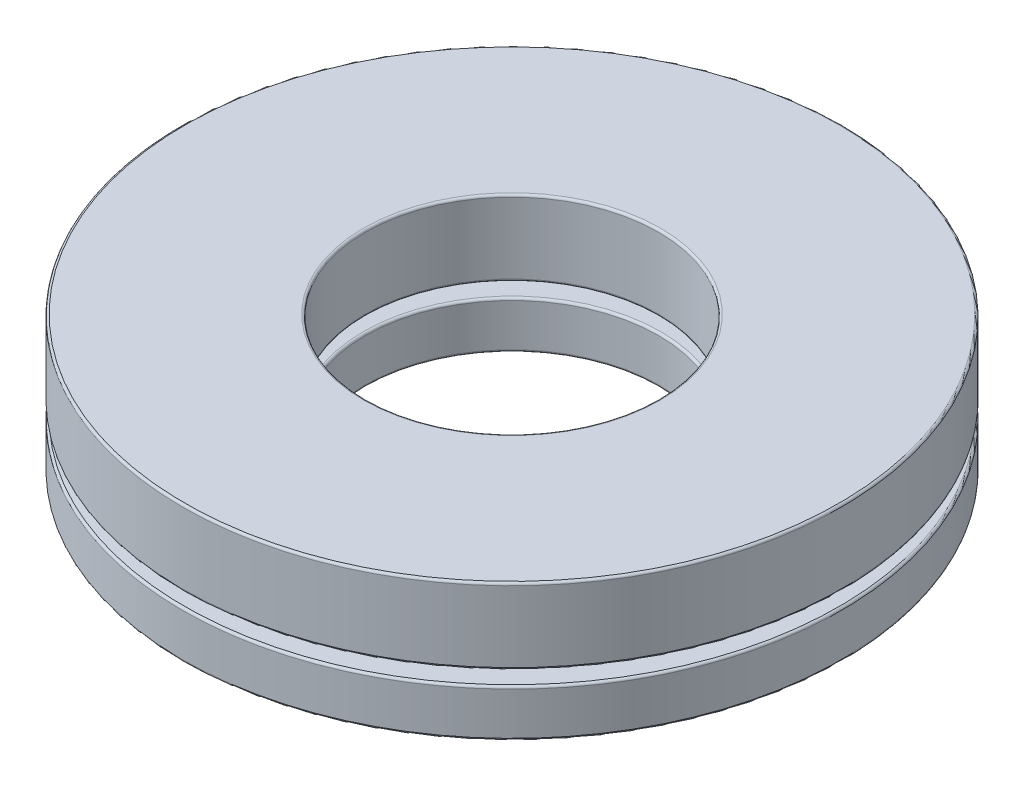
ISO-10303-21;
HEADER;
FILE_DESCRIPTION(('STEP AP214'),'2;1');
FILE_NAME('part.step','',(''),(''),'','','');
FILE_SCHEMA(('AUTOMOTIVE_DESIGN { 1 0 10303 214 1 1 1 1 }'));
ENDSEC;
DATA;
#1=APPLICATION_CONTEXT('core data for automotive mechanical design processes');
#2=APPLICATION_PROTOCOL_DEFINITION('international standard','automotive_design',2000,#1);
#3=PRODUCT_CONTEXT('',#1,'mechanical');
#4=PRODUCT('Part','Part','',(#3));
#5=PRODUCT_RELATED_PRODUCT_CATEGORY('part','',(#4));
#6=PRODUCT_DEFINITION_FORMATION('','',#4);
#7=PRODUCT_DEFINITION_CONTEXT('part definition',#1,'design');
#8=PRODUCT_DEFINITION('design','',#6,#7);
#9=PRODUCT_DEFINITION_SHAPE('','',#8);
#10=(LENGTH_UNIT() NAMED_UNIT(*) SI_UNIT(.MILLI.,.METRE.));
#11=(NAMED_UNIT(*) PLANE_ANGLE_UNIT() SI_UNIT($,.RADIAN.));
#12=(NAMED_UNIT(*) SI_UNIT($,.STERADIAN.) SOLID_ANGLE_UNIT());
#13=UNCERTAINTY_MEASURE_WITH_UNIT(LENGTH_MEASURE(1.E-05),#10,'distance_accuracy_value','');
#14=(GEOMETRIC_REPRESENTATION_CONTEXT(3) GLOBAL_UNCERTAINTY_ASSIGNED_CONTEXT((#13)) GLOBAL_UNIT_ASSIGNED_CONTEXT((#10,
#11,#12)) REPRESENTATION_CONTEXT('',''));
#15=CARTESIAN_POINT('',(0.,0.,0.));
#16=DIRECTION('',(0.,0.,1.));
#17=DIRECTION('',(1.,0.,0.));
#18=AXIS2_PLACEMENT_3D('',#15,#16,#17);
#19=CARTESIAN_POINT('',(0.,-2.4511,0.));
#20=DIRECTION('',(0.,-1.,0.));
#21=DIRECTION('',(0.,0.,-1.));
#22=AXIS2_PLACEMENT_3D('',#19,#20,#21);
#23=CYLINDRICAL_SURFACE('',#22,7.14375);
#24=CARTESIAN_POINT('',(0.,0.866055333333332,0.));
#25=DIRECTION('',(0.,1.,0.));
#26=DIRECTION('',(0.,0.,1.));
#27=AXIS2_PLACEMENT_3D('',#24,#25,#26);
#28=CIRCLE('',#27,7.14375);
#29=CARTESIAN_POINT('',(0.,0.866055333333332,7.14375));
#30=VERTEX_POINT('',#29);
#31=EDGE_CURVE('E11',#30,#30,#28,.T.);
#32=ORIENTED_EDGE('',*,*,#31,.T.);
#33=EDGE_LOOP('',(#32));
#34=FACE_BOUND('',#33,.T.);
#35=CARTESIAN_POINT('',(0.,2.402078,0.));
#36=DIRECTION('',(0.,-1.,0.));
#37=DIRECTION('',(0.,0.,-1.));
#38=AXIS2_PLACEMENT_3D('',#35,#36,#37);
#39=CIRCLE('',#38,7.14375);
#40=CARTESIAN_POINT('',(0.,2.402078,-7.14375));
#41=VERTEX_POINT('',#40);
#42=EDGE_CURVE('E45',#41,#41,#39,.T.);
#43=ORIENTED_EDGE('',*,*,#42,.T.);
#44=EDGE_LOOP('',(#43));
#45=FACE_BOUND('',#44,.T.);
#46=ADVANCED_FACE('F38',(#34,#45),#23,.T.);
#47=CARTESIAN_POINT('',(0.,2.4511,7.14375));
#48=DIRECTION('',(0.,-1.,0.));
#49=DIRECTION('',(0.,0.,-1.));
#50=AXIS2_PLACEMENT_3D('',#47,#48,#49);
#51=PLANE('',#50);
#52=CARTESIAN_POINT('',(0.,2.4511,0.));
#53=DIRECTION('',(0.,-1.,0.));
#54=DIRECTION('',(0.,0.,-1.));
#55=AXIS2_PLACEMENT_3D('',#52,#53,#54);
#56=CIRCLE('',#55,3.224022);
#57=CARTESIAN_POINT('',(0.,2.4511,-3.224022));
#58=VERTEX_POINT('',#57);
#59=EDGE_CURVE('E49',#58,#58,#56,.T.);
#60=ORIENTED_EDGE('',*,*,#59,.T.);
#61=EDGE_LOOP('',(#60));
#62=FACE_BOUND('',#61,.T.);
#63=CARTESIAN_POINT('',(0.,2.4511,0.));
#64=DIRECTION('',(0.,-1.,0.));
#65=DIRECTION('',(0.,0.,-1.));
#66=AXIS2_PLACEMENT_3D('',#63,#64,#65);
#67=CIRCLE('',#66,7.094728);
#68=CARTESIAN_POINT('',(0.,2.4511,-7.094728));
#69=VERTEX_POINT('',#68);
#70=EDGE_CURVE('E53',#69,#69,#67,.F.);
#71=ORIENTED_EDGE('',*,*,#70,.T.);
#72=EDGE_LOOP('',(#71));
#73=FACE_BOUND('',#72,.T.);
#74=ADVANCED_FACE('F81',(#62,#73),#51,.F.);
#75=CARTESIAN_POINT('',(0.,-2.4511,0.));
#76=DIRECTION('',(0.,-1.,0.));
#77=DIRECTION('',(0.,0.,-1.));
#78=AXIS2_PLACEMENT_3D('',#75,#76,#77);
#79=CYLINDRICAL_SURFACE('',#78,3.175);
#80=CARTESIAN_POINT('',(0.,0.866055333333332,0.));
#81=DIRECTION('',(0.,1.,0.));
#82=DIRECTION('',(0.,0.,1.));
#83=AXIS2_PLACEMENT_3D('',#80,#81,#82);
#84=CIRCLE('',#83,3.175);
#85=CARTESIAN_POINT('',(0.,0.866055333333332,3.175));
#86=VERTEX_POINT('',#85);
#87=EDGE_CURVE('E64',#86,#86,#84,.F.);
#88=ORIENTED_EDGE('',*,*,#87,.T.);
#89=EDGE_LOOP('',(#88));
#90=FACE_BOUND('',#89,.T.);
#91=CARTESIAN_POINT('',(0.,2.402078,0.));
#92=DIRECTION('',(0.,-1.,0.));
#93=DIRECTION('',(0.,0.,-1.));
#94=AXIS2_PLACEMENT_3D('',#91,#92,#93);
#95=CIRCLE('',#94,3.175);
#96=CARTESIAN_POINT('',(0.,2.402078,-3.175));
#97=VERTEX_POINT('',#96);
#98=EDGE_CURVE('E67',#97,#97,#95,.F.);
#99=ORIENTED_EDGE('',*,*,#98,.T.);
#100=EDGE_LOOP('',(#99));
#101=FACE_BOUND('',#100,.T.);
#102=ADVANCED_FACE('F71',(#90,#101),#79,.F.);
#103=CARTESIAN_POINT('',(0.,0.817033333333333,7.14375));
#104=DIRECTION('',(0.,1.,0.));
#105=DIRECTION('',(0.,0.,1.));
#106=AXIS2_PLACEMENT_3D('',#103,#104,#105);
#107=PLANE('',#106);
#108=CARTESIAN_POINT('',(0.,0.817033333333333,0.));
#109=DIRECTION('',(0.,1.,0.));
#110=DIRECTION('',(0.,0.,1.));
#111=AXIS2_PLACEMENT_3D('',#108,#109,#110);
#112=CIRCLE('',#111,3.224022);
#113=CARTESIAN_POINT('',(0.,0.817033333333333,3.224022));
#114=VERTEX_POINT('',#113);
#115=EDGE_CURVE('E58',#114,#114,#112,.T.);
#116=ORIENTED_EDGE('',*,*,#115,.T.);
#117=EDGE_LOOP('',(#116));
#118=FACE_BOUND('',#117,.T.);
#119=CARTESIAN_POINT('',(0.,0.817033333333333,0.));
#120=DIRECTION('',(0.,1.,0.));
#121=DIRECTION('',(0.,0.,1.));
#122=AXIS2_PLACEMENT_3D('',#119,#120,#121);
#123=CIRCLE('',#122,7.094728);
#124=CARTESIAN_POINT('',(0.,0.817033333333333,7.094728));
#125=VERTEX_POINT('',#124);
#126=EDGE_CURVE('E61',#125,#125,#123,.F.);
#127=ORIENTED_EDGE('',*,*,#126,.T.);
#128=EDGE_LOOP('',(#127));
#129=FACE_BOUND('',#128,.T.);
#130=ADVANCED_FACE('F100',(#118,#129),#107,.F.);
#131=CARTESIAN_POINT('',(0.,0.866055333333332,0.));
#132=DIRECTION('',(0.,1.,0.));
#133=DIRECTION('',(0.,0.,1.));
#134=AXIS2_PLACEMENT_3D('',#131,#132,#133);
#135=TOROIDAL_SURFACE('',#134,3.224022,0.049022);
#136=ORIENTED_EDGE('',*,*,#115,.F.);
#137=EDGE_LOOP('',(#136));
#138=FACE_BOUND('',#137,.T.);
#139=ORIENTED_EDGE('',*,*,#87,.F.);
#140=EDGE_LOOP('',(#139));
#141=FACE_BOUND('',#140,.T.);
#142=ADVANCED_FACE('F77',(#138,#141),#135,.T.);
#143=CARTESIAN_POINT('',(0.,2.402078,0.));
#144=DIRECTION('',(0.,-1.,0.));
#145=DIRECTION('',(0.,0.,-1.));
#146=AXIS2_PLACEMENT_3D('',#143,#144,#145);
#147=TOROIDAL_SURFACE('',#146,3.224022,0.049022);
#148=ORIENTED_EDGE('',*,*,#98,.F.);
#149=EDGE_LOOP('',(#148));
#150=FACE_BOUND('',#149,.T.);
#151=ORIENTED_EDGE('',*,*,#59,.F.);
#152=EDGE_LOOP('',(#151));
#153=FACE_BOUND('',#152,.T.);
#154=ADVANCED_FACE('F73',(#150,#153),#147,.T.);
#155=CARTESIAN_POINT('',(0.,0.866055333333332,0.));
#156=DIRECTION('',(0.,1.,0.));
#157=DIRECTION('',(0.,0.,1.));
#158=AXIS2_PLACEMENT_3D('',#155,#156,#157);
#159=TOROIDAL_SURFACE('',#158,7.094728,0.049022);
#160=ORIENTED_EDGE('',*,*,#31,.F.);
#161=EDGE_LOOP('',(#160));
#162=FACE_BOUND('',#161,.T.);
#163=ORIENTED_EDGE('',*,*,#126,.F.);
#164=EDGE_LOOP('',(#163));
#165=FACE_BOUND('',#164,.T.);
#166=ADVANCED_FACE('F76',(#162,#165),#159,.T.);
#167=CARTESIAN_POINT('',(0.,2.402078,0.));
#168=DIRECTION('',(0.,-1.,0.));
#169=DIRECTION('',(0.,0.,-1.));
#170=AXIS2_PLACEMENT_3D('',#167,#168,#169);
#171=TOROIDAL_SURFACE('',#170,7.094728,0.049022);
#172=ORIENTED_EDGE('',*,*,#70,.F.);
#173=EDGE_LOOP('',(#172));
#174=FACE_BOUND('',#173,.T.);
#175=ORIENTED_EDGE('',*,*,#42,.F.);
#176=EDGE_LOOP('',(#175));
#177=FACE_BOUND('',#176,.T.);
#178=ADVANCED_FACE('F40',(#174,#177),#171,.T.);
#179=CLOSED_SHELL('',(#46,#74,#102,#130,#142,#154,#166,#178));
#180=MANIFOLD_SOLID_BREP('B2',#179);
#181=CARTESIAN_POINT('',(-4.03376180485845,0.,3.21681769646495));
#182=DIRECTION('',(0.,1.,0.));
#183=DIRECTION('',(0.781831482468022,0.,-0.623489801858743));
#184=AXIS2_PLACEMENT_3D('',#181,#182,#183);
#185=SPHERICAL_SURFACE('',#184,0.817033333333333);
#186=CARTESIAN_POINT('',(-4.03376180485845,0.817033333333333,3.21681769646495));
#187=VERTEX_POINT('',#186);
#188=VERTEX_LOOP('',#187);
#189=FACE_BOUND('',#188,.T.);
#190=ADVANCED_FACE('F166',(#189),#185,.T.);
#191=CLOSED_SHELL('',(#190));
#192=MANIFOLD_SOLID_BREP('B6',#191);
#193=CARTESIAN_POINT('',(-5.03001869691311,0.,-1.14806894363081));
#194=DIRECTION('',(0.,1.,0.));
#195=DIRECTION('',(0.974927912181826,0.,0.222520933956305));
#196=AXIS2_PLACEMENT_3D('',#193,#194,#195);
#197=SPHERICAL_SURFACE('',#196,0.817033333333333);
#198=CARTESIAN_POINT('',(-5.03001869691311,0.817033333333333,-1.14806894363081));
#199=VERTEX_POINT('',#198);
#200=VERTEX_LOOP('',#199);
#201=FACE_BOUND('',#200,.T.);
#202=ADVANCED_FACE('F185',(#201),#197,.T.);
#203=CLOSED_SHELL('',(#202));
#204=MANIFOLD_SOLID_BREP('B34',#203);
#205=CARTESIAN_POINT('',(-2.23856891650969,0.,-4.64843625283403));
#206=DIRECTION('',(0.,1.,0.));
#207=DIRECTION('',(0.433883739117565,0.,0.900968867902416));
#208=AXIS2_PLACEMENT_3D('',#205,#206,#207);
#209=SPHERICAL_SURFACE('',#208,0.817033333333333);
#210=CARTESIAN_POINT('',(-2.23856891650969,0.817033333333333,-4.64843625283403));
#211=VERTEX_POINT('',#210);
#212=VERTEX_LOOP('',#211);
#213=FACE_BOUND('',#212,.T.);
#214=ADVANCED_FACE('F204',(#213),#209,.T.);
#215=CLOSED_SHELL('',(#214));
#216=MANIFOLD_SOLID_BREP('B162',#215);
#217=CARTESIAN_POINT('',(2.23856891650962,0.,-4.64843625283406));
#218=DIRECTION('',(0.,1.,0.));
#219=DIRECTION('',(-0.433883739117553,0.,0.900968867902422));
#220=AXIS2_PLACEMENT_3D('',#217,#218,#219);
#221=SPHERICAL_SURFACE('',#220,0.817033333333333);
#222=CARTESIAN_POINT('',(2.23856891650962,0.817033333333333,-4.64843625283406));
#223=VERTEX_POINT('',#222);
#224=VERTEX_LOOP('',#223);
#225=FACE_BOUND('',#224,.T.);
#226=ADVANCED_FACE('F223',(#225),#221,.T.);
#227=CLOSED_SHELL('',(#226));
#228=MANIFOLD_SOLID_BREP('B181',#227);
#229=CARTESIAN_POINT('',(5.03001869691309,0.,-1.14806894363088));
#230=DIRECTION('',(0.,1.,0.));
#231=DIRECTION('',(-0.974927912181823,0.,0.222520933956318));
#232=AXIS2_PLACEMENT_3D('',#229,#230,#231);
#233=SPHERICAL_SURFACE('',#232,0.817033333333333);
#234=CARTESIAN_POINT('',(5.03001869691309,0.817033333333333,-1.14806894363088));
#235=VERTEX_POINT('',#234);
#236=VERTEX_LOOP('',#235);
#237=FACE_BOUND('',#236,.T.);
#238=ADVANCED_FACE('F242',(#237),#233,.T.);
#239=CLOSED_SHELL('',(#238));
#240=MANIFOLD_SOLID_BREP('B200',#239);
#241=CARTESIAN_POINT('',(4.0337618048585,0.,3.2168176964649));
#242=DIRECTION('',(0.,1.,0.));
#243=DIRECTION('',(-0.781831482468031,0.,-0.623489801858732));
#244=AXIS2_PLACEMENT_3D('',#241,#242,#243);
#245=SPHERICAL_SURFACE('',#244,0.817033333333333);
#246=CARTESIAN_POINT('',(4.0337618048585,0.817033333333333,3.2168176964649));
#247=VERTEX_POINT('',#246);
#248=VERTEX_LOOP('',#247);
#249=FACE_BOUND('',#248,.T.);
#250=ADVANCED_FACE('F261',(#249),#245,.T.);
#251=CLOSED_SHELL('',(#250));
#252=MANIFOLD_SOLID_BREP('B219',#251);
#253=CARTESIAN_POINT('',(0.,0.,5.159375));
#254=DIRECTION('',(0.,1.,0.));
#255=DIRECTION('',(0.,0.,-1.));
#256=AXIS2_PLACEMENT_3D('',#253,#254,#255);
#257=SPHERICAL_SURFACE('',#256,0.817033333333333);
#258=CARTESIAN_POINT('',(0.,0.817033333333333,5.159375));
#259=VERTEX_POINT('',#258);
#260=VERTEX_LOOP('',#259);
#261=FACE_BOUND('',#260,.T.);
#262=ADVANCED_FACE('F281',(#261),#257,.T.);
#263=CLOSED_SHELL('',(#262));
#264=MANIFOLD_SOLID_BREP('B238',#263);
#265=CARTESIAN_POINT('',(0.,-2.4511,0.));
#266=DIRECTION('',(0.,-1.,0.));
#267=DIRECTION('',(0.,0.,-1.));
#268=AXIS2_PLACEMENT_3D('',#265,#266,#267);
#269=CYLINDRICAL_SURFACE('',#268,7.14375);
#270=CARTESIAN_POINT('',(0.,-0.461623833333338,0.));
#271=DIRECTION('',(0.,1.,0.));
#272=DIRECTION('',(0.,0.,1.));
#273=AXIS2_PLACEMENT_3D('',#270,#271,#272);
#274=CIRCLE('',#273,7.14375);
#275=CARTESIAN_POINT('',(0.,-0.461623833333338,7.14375));
#276=VERTEX_POINT('',#275);
#277=EDGE_CURVE('E280',#276,#276,#274,.T.);
#278=ORIENTED_EDGE('',*,*,#277,.T.);
#279=EDGE_LOOP('',(#278));
#280=FACE_BOUND('',#279,.T.);
#281=CARTESIAN_POINT('',(0.,0.461623833333328,0.));
#282=DIRECTION('',(0.,-1.,0.));
#283=DIRECTION('',(0.,0.,-1.));
#284=AXIS2_PLACEMENT_3D('',#281,#282,#283);
#285=CIRCLE('',#284,7.14375);
#286=CARTESIAN_POINT('',(0.,0.461623833333328,-7.14375));
#287=VERTEX_POINT('',#286);
#288=EDGE_CURVE('E301',#287,#287,#285,.T.);
#289=ORIENTED_EDGE('',*,*,#288,.T.);
#290=EDGE_LOOP('',(#289));
#291=FACE_BOUND('',#290,.T.);
#292=ADVANCED_FACE('F294',(#280,#291),#269,.T.);
#293=CARTESIAN_POINT('',(0.,-0.510645833333338,7.14375));
#294=DIRECTION('',(0.,1.,0.));
#295=DIRECTION('',(0.,0.,1.));
#296=AXIS2_PLACEMENT_3D('',#293,#294,#295);
#297=PLANE('',#296);
#298=CARTESIAN_POINT('',(0.,-0.510645833333338,0.));
#299=DIRECTION('',(0.,1.,0.));
#300=DIRECTION('',(0.,0.,1.));
#301=AXIS2_PLACEMENT_3D('',#298,#299,#300);
#302=CIRCLE('',#301,3.224022);
#303=CARTESIAN_POINT('',(0.,-0.510645833333338,3.224022));
#304=VERTEX_POINT('',#303);
#305=EDGE_CURVE('E314',#304,#304,#302,.T.);
#306=ORIENTED_EDGE('',*,*,#305,.T.);
#307=EDGE_LOOP('',(#306));
#308=FACE_BOUND('',#307,.T.);
#309=CARTESIAN_POINT('',(0.,-0.510645833333338,0.));
#310=DIRECTION('',(0.,1.,0.));
#311=DIRECTION('',(0.,0.,1.));
#312=AXIS2_PLACEMENT_3D('',#309,#310,#311);
#313=CIRCLE('',#312,7.094728);
#314=CARTESIAN_POINT('',(0.,-0.510645833333338,7.094728));
#315=VERTEX_POINT('',#314);
#316=EDGE_CURVE('E317',#315,#315,#313,.F.);
#317=ORIENTED_EDGE('',*,*,#316,.T.);
#318=EDGE_LOOP('',(#317));
#319=FACE_BOUND('',#318,.T.);
#320=CARTESIAN_POINT('',(-4.03376180485845,-0.510645833333338,3.21681769646495));
#321=DIRECTION('',(0.,1.,0.));
#322=DIRECTION('',(-0.781831482468022,0.,0.623489801858743));
#323=AXIS2_PLACEMENT_3D('',#320,#321,#322);
#324=CIRCLE('',#323,0.637796441411426);
#325=CARTESIAN_POINT('',(-4.53241114215998,-0.510645833333338,3.61447727334677));
#326=VERTEX_POINT('',#325);
#327=EDGE_CURVE('E362',#326,#326,#324,.T.);
#328=ORIENTED_EDGE('',*,*,#327,.T.);
#329=EDGE_LOOP('',(#328));
#330=FACE_BOUND('',#329,.T.);
#331=CARTESIAN_POINT('',(-5.03001869691311,-0.510645833333338,-1.14806894363081));
#332=DIRECTION('',(0.,1.,0.));
#333=DIRECTION('',(-0.974927912181826,0.,-0.222520933956305));
#334=AXIS2_PLACEMENT_3D('',#331,#332,#333);
#335=CIRCLE('',#334,0.637796441411426);
#336=CARTESIAN_POINT('',(-5.65182424993535,-0.510645833333338,-1.28999200344769));
#337=VERTEX_POINT('',#336);
#338=EDGE_CURVE('E356',#337,#337,#335,.T.);
#339=ORIENTED_EDGE('',*,*,#338,.T.);
#340=EDGE_LOOP('',(#339));
#341=FACE_BOUND('',#340,.T.);
#342=CARTESIAN_POINT('',(-2.23856891650969,-0.510645833333338,-4.64843625283403));
#343=DIRECTION('',(0.,1.,0.));
#344=DIRECTION('',(-0.433883739117565,0.,-0.900968867902416));
#345=AXIS2_PLACEMENT_3D('',#342,#343,#344);
#346=CIRCLE('',#345,0.637796441411426);
#347=CARTESIAN_POINT('',(-2.51529842130515,-0.510645833333338,-5.22307099060467));
#348=VERTEX_POINT('',#347);
#349=EDGE_CURVE('E350',#348,#348,#346,.T.);
#350=ORIENTED_EDGE('',*,*,#349,.T.);
#351=EDGE_LOOP('',(#350));
#352=FACE_BOUND('',#351,.T.);
#353=CARTESIAN_POINT('',(2.23856891650962,-0.510645833333338,-4.64843625283406));
#354=DIRECTION('',(0.,1.,0.));
#355=DIRECTION('',(0.433883739117553,0.,-0.900968867902422));
#356=AXIS2_PLACEMENT_3D('',#353,#354,#355);
#357=CIRCLE('',#356,0.637796441411426);
#358=CARTESIAN_POINT('',(2.51529842130508,-0.510645833333338,-5.2230709906047));
#359=VERTEX_POINT('',#358);
#360=EDGE_CURVE('E344',#359,#359,#357,.T.);
#361=ORIENTED_EDGE('',*,*,#360,.T.);
#362=EDGE_LOOP('',(#361));
#363=FACE_BOUND('',#362,.T.);
#364=CARTESIAN_POINT('',(5.03001869691309,-0.510645833333338,-1.14806894363088));
#365=DIRECTION('',(0.,1.,0.));
#366=DIRECTION('',(0.974927912181823,0.,-0.222520933956318));
#367=AXIS2_PLACEMENT_3D('',#364,#365,#366);
#368=CIRCLE('',#367,0.637796441411426);
#369=CARTESIAN_POINT('',(5.65182424993533,-0.510645833333338,-1.28999200344777));
#370=VERTEX_POINT('',#369);
#371=EDGE_CURVE('E338',#370,#370,#368,.T.);
#372=ORIENTED_EDGE('',*,*,#371,.T.);
#373=EDGE_LOOP('',(#372));
#374=FACE_BOUND('',#373,.T.);
#375=CARTESIAN_POINT('',(4.0337618048585,-0.510645833333338,3.2168176964649));
#376=DIRECTION('',(0.,1.,0.));
#377=DIRECTION('',(0.781831482468031,0.,0.623489801858732));
#378=AXIS2_PLACEMENT_3D('',#375,#376,#377);
#379=CIRCLE('',#378,0.637796441411426);
#380=CARTESIAN_POINT('',(4.53241114216003,-0.510645833333338,3.61447727334671));
#381=VERTEX_POINT('',#380);
#382=EDGE_CURVE('E330',#381,#381,#379,.T.);
#383=ORIENTED_EDGE('',*,*,#382,.T.);
#384=EDGE_LOOP('',(#383));
#385=FACE_BOUND('',#384,.T.);
#386=CARTESIAN_POINT('',(0.,-0.510645833333338,5.159375));
#387=DIRECTION('',(0.,1.,0.));
#388=DIRECTION('',(0.,0.,1.));
#389=AXIS2_PLACEMENT_3D('',#386,#387,#388);
#390=CIRCLE('',#389,0.637796441411426);
#391=CARTESIAN_POINT('',(0.,-0.510645833333338,5.79717144141143));
#392=VERTEX_POINT('',#391);
#393=EDGE_CURVE('E326',#392,#392,#390,.T.);
#394=ORIENTED_EDGE('',*,*,#393,.T.);
#395=EDGE_LOOP('',(#394));
#396=FACE_BOUND('',#395,.T.);
#397=ADVANCED_FACE('F380',(#308,#319,#330,#341,#352,#363,#374,#385,#396),#297,.F.);
#398=CARTESIAN_POINT('',(0.,-2.4511,0.));
#399=DIRECTION('',(0.,-1.,0.));
#400=DIRECTION('',(0.,0.,-1.));
#401=AXIS2_PLACEMENT_3D('',#398,#399,#400);
#402=CYLINDRICAL_SURFACE('',#401,3.175);
#403=CARTESIAN_POINT('',(0.,-0.461623833333338,0.));
#404=DIRECTION('',(0.,1.,0.));
#405=DIRECTION('',(0.,0.,1.));
#406=AXIS2_PLACEMENT_3D('',#403,#404,#405);
#407=CIRCLE('',#406,3.175);
#408=CARTESIAN_POINT('',(0.,-0.461623833333338,3.175));
#409=VERTEX_POINT('',#408);
#410=EDGE_CURVE('E320',#409,#409,#407,.F.);
#411=ORIENTED_EDGE('',*,*,#410,.T.);
#412=EDGE_LOOP('',(#411));
#413=FACE_BOUND('',#412,.T.);
#414=CARTESIAN_POINT('',(0.,0.461623833333328,0.));
#415=DIRECTION('',(0.,-1.,0.));
#416=DIRECTION('',(0.,0.,-1.));
#417=AXIS2_PLACEMENT_3D('',#414,#415,#416);
#418=CIRCLE('',#417,3.175);
#419=CARTESIAN_POINT('',(0.,0.461623833333328,-3.175));
#420=VERTEX_POINT('',#419);
#421=EDGE_CURVE('E323',#420,#420,#418,.F.);
#422=ORIENTED_EDGE('',*,*,#421,.T.);
#423=EDGE_LOOP('',(#422));
#424=FACE_BOUND('',#423,.T.);
#425=ADVANCED_FACE('F383',(#413,#424),#402,.F.);
#426=CARTESIAN_POINT('',(0.,0.510645833333328,7.14375));
#427=DIRECTION('',(0.,-1.,0.));
#428=DIRECTION('',(0.,0.,-1.));
#429=AXIS2_PLACEMENT_3D('',#426,#427,#428);
#430=PLANE('',#429);
#431=CARTESIAN_POINT('',(0.,0.510645833333328,0.));
#432=DIRECTION('',(0.,-1.,0.));
#433=DIRECTION('',(0.,0.,-1.));
#434=AXIS2_PLACEMENT_3D('',#431,#432,#433);
#435=CIRCLE('',#434,3.224022);
#436=CARTESIAN_POINT('',(0.,0.510645833333328,-3.224022));
#437=VERTEX_POINT('',#436);
#438=EDGE_CURVE('E305',#437,#437,#435,.T.);
#439=ORIENTED_EDGE('',*,*,#438,.T.);
#440=EDGE_LOOP('',(#439));
#441=FACE_BOUND('',#440,.T.);
#442=CARTESIAN_POINT('',(0.,0.510645833333328,0.));
#443=DIRECTION('',(0.,-1.,0.));
#444=DIRECTION('',(0.,0.,-1.));
#445=AXIS2_PLACEMENT_3D('',#442,#443,#444);
#446=CIRCLE('',#445,7.094728);
#447=CARTESIAN_POINT('',(0.,0.510645833333328,-7.094728));
#448=VERTEX_POINT('',#447);
#449=EDGE_CURVE('E309',#448,#448,#446,.F.);
#450=ORIENTED_EDGE('',*,*,#449,.T.);
#451=EDGE_LOOP('',(#450));
#452=FACE_BOUND('',#451,.T.);
#453=CARTESIAN_POINT('',(-4.03376180485845,0.510645833333328,3.21681769646495));
#454=DIRECTION('',(0.,-1.,0.));
#455=DIRECTION('',(0.781831482468022,0.,-0.623489801858743));
#456=AXIS2_PLACEMENT_3D('',#453,#454,#455);
#457=CIRCLE('',#456,0.637796441411434);
#458=CARTESIAN_POINT('',(-3.53511246755692,0.510645833333328,2.81915811958313));
#459=VERTEX_POINT('',#458);
#460=EDGE_CURVE('E365',#459,#459,#457,.T.);
#461=ORIENTED_EDGE('',*,*,#460,.T.);
#462=EDGE_LOOP('',(#461));
#463=FACE_BOUND('',#462,.T.);
#464=CARTESIAN_POINT('',(-5.03001869691311,0.510645833333328,-1.14806894363081));
#465=DIRECTION('',(0.,-1.,0.));
#466=DIRECTION('',(0.974927912181826,0.,0.222520933956305));
#467=AXIS2_PLACEMENT_3D('',#464,#465,#466);
#468=CIRCLE('',#467,0.637796441411434);
#469=CARTESIAN_POINT('',(-4.40821314389086,0.510645833333328,-1.00614588381393));
#470=VERTEX_POINT('',#469);
#471=EDGE_CURVE('E359',#470,#470,#468,.T.);
#472=ORIENTED_EDGE('',*,*,#471,.T.);
#473=EDGE_LOOP('',(#472));
#474=FACE_BOUND('',#473,.T.);
#475=CARTESIAN_POINT('',(-2.23856891650969,0.510645833333328,-4.64843625283403));
#476=DIRECTION('',(0.,-1.,0.));
#477=DIRECTION('',(0.433883739117565,0.,0.900968867902416));
#478=AXIS2_PLACEMENT_3D('',#475,#476,#477);
#479=CIRCLE('',#478,0.637796441411434);
#480=CARTESIAN_POINT('',(-1.96183941171422,0.510645833333328,-4.07380151506338));
#481=VERTEX_POINT('',#480);
#482=EDGE_CURVE('E353',#481,#481,#479,.T.);
#483=ORIENTED_EDGE('',*,*,#482,.T.);
#484=EDGE_LOOP('',(#483));
#485=FACE_BOUND('',#484,.T.);
#486=CARTESIAN_POINT('',(2.23856891650962,0.510645833333328,-4.64843625283406));
#487=DIRECTION('',(0.,-1.,0.));
#488=DIRECTION('',(-0.433883739117553,0.,0.900968867902422));
#489=AXIS2_PLACEMENT_3D('',#486,#487,#488);
#490=CIRCLE('',#489,0.637796441411434);
#491=CARTESIAN_POINT('',(1.96183941171416,0.510645833333328,-4.07380151506341));
#492=VERTEX_POINT('',#491);
#493=EDGE_CURVE('E347',#492,#492,#490,.T.);
#494=ORIENTED_EDGE('',*,*,#493,.T.);
#495=EDGE_LOOP('',(#494));
#496=FACE_BOUND('',#495,.T.);
#497=CARTESIAN_POINT('',(5.03001869691309,0.510645833333328,-1.14806894363088));
#498=DIRECTION('',(0.,-1.,0.));
#499=DIRECTION('',(-0.974927912181823,0.,0.222520933956318));
#500=AXIS2_PLACEMENT_3D('',#497,#498,#499);
#501=CIRCLE('',#500,0.637796441411434);
#502=CARTESIAN_POINT('',(4.40821314389085,0.510645833333328,-1.00614588381399));
#503=VERTEX_POINT('',#502);
#504=EDGE_CURVE('E341',#503,#503,#501,.T.);
#505=ORIENTED_EDGE('',*,*,#504,.T.);
#506=EDGE_LOOP('',(#505));
#507=FACE_BOUND('',#506,.T.);
#508=CARTESIAN_POINT('',(4.0337618048585,0.510645833333328,3.2168176964649));
#509=DIRECTION('',(0.,-1.,0.));
#510=DIRECTION('',(-0.781831482468031,0.,-0.623489801858732));
#511=AXIS2_PLACEMENT_3D('',#508,#509,#510);
#512=CIRCLE('',#511,0.637796441411434);
#513=CARTESIAN_POINT('',(3.53511246755696,0.510645833333328,2.81915811958308));
#514=VERTEX_POINT('',#513);
#515=EDGE_CURVE('E335',#514,#514,#512,.T.);
#516=ORIENTED_EDGE('',*,*,#515,.T.);
#517=EDGE_LOOP('',(#516));
#518=FACE_BOUND('',#517,.T.);
#519=CARTESIAN_POINT('',(0.,0.510645833333328,5.159375));
#520=DIRECTION('',(0.,-1.,0.));
#521=DIRECTION('',(0.,0.,-1.));
#522=AXIS2_PLACEMENT_3D('',#519,#520,#521);
#523=CIRCLE('',#522,0.637796441411434);
#524=CARTESIAN_POINT('',(0.,0.510645833333328,4.52157855858857));
#525=VERTEX_POINT('',#524);
#526=EDGE_CURVE('E327',#525,#525,#523,.T.);
#527=ORIENTED_EDGE('',*,*,#526,.T.);
#528=EDGE_LOOP('',(#527));
#529=FACE_BOUND('',#528,.T.);
#530=ADVANCED_FACE('F369',(#441,#452,#463,#474,#485,#496,#507,#518,#529),#430,.F.);
#531=CARTESIAN_POINT('',(0.,0.,5.159375));
#532=DIRECTION('',(0.,1.,0.));
#533=DIRECTION('',(0.,0.,-1.));
#534=AXIS2_PLACEMENT_3D('',#531,#532,#533);
#535=SPHERICAL_SURFACE('',#534,0.817033333333333);
#536=ORIENTED_EDGE('',*,*,#526,.F.);
#537=EDGE_LOOP('',(#536));
#538=FACE_BOUND('',#537,.T.);
#539=ORIENTED_EDGE('',*,*,#393,.F.);
#540=EDGE_LOOP('',(#539));
#541=FACE_BOUND('',#540,.T.);
#542=ADVANCED_FACE('F398',(#538,#541),#535,.F.);
#543=CARTESIAN_POINT('',(4.0337618048585,0.,3.2168176964649));
#544=DIRECTION('',(0.,1.,0.));
#545=DIRECTION('',(-0.781831482468031,0.,-0.623489801858732));
#546=AXIS2_PLACEMENT_3D('',#543,#544,#545);
#547=SPHERICAL_SURFACE('',#546,0.817033333333333);
#548=ORIENTED_EDGE('',*,*,#515,.F.);
#549=EDGE_LOOP('',(#548));
#550=FACE_BOUND('',#549,.T.);
#551=ORIENTED_EDGE('',*,*,#382,.F.);
#552=EDGE_LOOP('',(#551));
#553=FACE_BOUND('',#552,.T.);
#554=ADVANCED_FACE('F400',(#550,#553),#547,.F.);
#555=CARTESIAN_POINT('',(5.03001869691309,0.,-1.14806894363088));
#556=DIRECTION('',(0.,1.,0.));
#557=DIRECTION('',(-0.974927912181823,0.,0.222520933956318));
#558=AXIS2_PLACEMENT_3D('',#555,#556,#557);
#559=SPHERICAL_SURFACE('',#558,0.817033333333333);
#560=ORIENTED_EDGE('',*,*,#504,.F.);
#561=EDGE_LOOP('',(#560));
#562=FACE_BOUND('',#561,.T.);
#563=ORIENTED_EDGE('',*,*,#371,.F.);
#564=EDGE_LOOP('',(#563));
#565=FACE_BOUND('',#564,.T.);
#566=ADVANCED_FACE('F407',(#562,#565),#559,.F.);
#567=CARTESIAN_POINT('',(2.23856891650962,0.,-4.64843625283406));
#568=DIRECTION('',(0.,1.,0.));
#569=DIRECTION('',(-0.433883739117553,0.,0.900968867902422));
#570=AXIS2_PLACEMENT_3D('',#567,#568,#569);
#571=SPHERICAL_SURFACE('',#570,0.817033333333333);
#572=ORIENTED_EDGE('',*,*,#493,.F.);
#573=EDGE_LOOP('',(#572));
#574=FACE_BOUND('',#573,.T.);
#575=ORIENTED_EDGE('',*,*,#360,.F.);
#576=EDGE_LOOP('',(#575));
#577=FACE_BOUND('',#576,.T.);
#578=ADVANCED_FACE('F506',(#574,#577),#571,.F.);
#579=CARTESIAN_POINT('',(-2.23856891650969,0.,-4.64843625283403));
#580=DIRECTION('',(0.,1.,0.));
#581=DIRECTION('',(0.433883739117565,0.,0.900968867902416));
#582=AXIS2_PLACEMENT_3D('',#579,#580,#581);
#583=SPHERICAL_SURFACE('',#582,0.817033333333333);
#584=ORIENTED_EDGE('',*,*,#482,.F.);
#585=EDGE_LOOP('',(#584));
#586=FACE_BOUND('',#585,.T.);
#587=ORIENTED_EDGE('',*,*,#349,.F.);
#588=EDGE_LOOP('',(#587));
#589=FACE_BOUND('',#588,.T.);
#590=ADVANCED_FACE('F496',(#586,#589),#583,.F.);
#591=CARTESIAN_POINT('',(-5.03001869691311,0.,-1.14806894363081));
#592=DIRECTION('',(0.,1.,0.));
#593=DIRECTION('',(0.974927912181826,0.,0.222520933956305));
#594=AXIS2_PLACEMENT_3D('',#591,#592,#593);
#595=SPHERICAL_SURFACE('',#594,0.817033333333333);
#596=ORIENTED_EDGE('',*,*,#471,.F.);
#597=EDGE_LOOP('',(#596));
#598=FACE_BOUND('',#597,.T.);
#599=ORIENTED_EDGE('',*,*,#338,.F.);
#600=EDGE_LOOP('',(#599));
#601=FACE_BOUND('',#600,.T.);
#602=ADVANCED_FACE('F376',(#598,#601),#595,.F.);
#603=CARTESIAN_POINT('',(-4.03376180485845,0.,3.21681769646495));
#604=DIRECTION('',(0.,1.,0.));
#605=DIRECTION('',(0.781831482468022,0.,-0.623489801858743));
#606=AXIS2_PLACEMENT_3D('',#603,#604,#605);
#607=SPHERICAL_SURFACE('',#606,0.817033333333333);
#608=ORIENTED_EDGE('',*,*,#460,.F.);
#609=EDGE_LOOP('',(#608));
#610=FACE_BOUND('',#609,.T.);
#611=ORIENTED_EDGE('',*,*,#327,.F.);
#612=EDGE_LOOP('',(#611));
#613=FACE_BOUND('',#612,.T.);
#614=ADVANCED_FACE('F372',(#610,#613),#607,.F.);
#615=CARTESIAN_POINT('',(0.,-0.461623833333338,0.));
#616=DIRECTION('',(0.,1.,0.));
#617=DIRECTION('',(0.,0.,1.));
#618=AXIS2_PLACEMENT_3D('',#615,#616,#617);
#619=TOROIDAL_SURFACE('',#618,3.224022,0.049022);
#620=ORIENTED_EDGE('',*,*,#305,.F.);
#621=EDGE_LOOP('',(#620));
#622=FACE_BOUND('',#621,.T.);
#623=ORIENTED_EDGE('',*,*,#410,.F.);
#624=EDGE_LOOP('',(#623));
#625=FACE_BOUND('',#624,.T.);
#626=ADVANCED_FACE('F375',(#622,#625),#619,.T.);
#627=CARTESIAN_POINT('',(0.,0.461623833333328,0.));
#628=DIRECTION('',(0.,-1.,0.));
#629=DIRECTION('',(0.,0.,-1.));
#630=AXIS2_PLACEMENT_3D('',#627,#628,#629);
#631=TOROIDAL_SURFACE('',#630,3.224022,0.049022);
#632=ORIENTED_EDGE('',*,*,#421,.F.);
#633=EDGE_LOOP('',(#632));
#634=FACE_BOUND('',#633,.T.);
#635=ORIENTED_EDGE('',*,*,#438,.F.);
#636=EDGE_LOOP('',(#635));
#637=FACE_BOUND('',#636,.T.);
#638=ADVANCED_FACE('F421',(#634,#637),#631,.T.);
#639=CARTESIAN_POINT('',(0.,-0.461623833333338,0.));
#640=DIRECTION('',(0.,1.,0.));
#641=DIRECTION('',(0.,0.,1.));
#642=AXIS2_PLACEMENT_3D('',#639,#640,#641);
#643=TOROIDAL_SURFACE('',#642,7.094728,0.049022);
#644=ORIENTED_EDGE('',*,*,#277,.F.);
#645=EDGE_LOOP('',(#644));
#646=FACE_BOUND('',#645,.T.);
#647=ORIENTED_EDGE('',*,*,#316,.F.);
#648=EDGE_LOOP('',(#647));
#649=FACE_BOUND('',#648,.T.);
#650=ADVANCED_FACE('F424',(#646,#649),#643,.T.);
#651=CARTESIAN_POINT('',(0.,0.461623833333328,0.));
#652=DIRECTION('',(0.,-1.,0.));
#653=DIRECTION('',(0.,0.,-1.));
#654=AXIS2_PLACEMENT_3D('',#651,#652,#653);
#655=TOROIDAL_SURFACE('',#654,7.094728,0.049022);
#656=ORIENTED_EDGE('',*,*,#449,.F.);
#657=EDGE_LOOP('',(#656));
#658=FACE_BOUND('',#657,.T.);
#659=ORIENTED_EDGE('',*,*,#288,.F.);
#660=EDGE_LOOP('',(#659));
#661=FACE_BOUND('',#660,.T.);
#662=ADVANCED_FACE('F296',(#658,#661),#655,.T.);
#663=CLOSED_SHELL('',(#292,#397,#425,#530,#542,#554,#566,#578,#590,#602,#614,#626,#638,#650,#662));
#664=MANIFOLD_SOLID_BREP('B257',#663);
#665=ADVANCED_BREP_SHAPE_REPRESENTATION('',(#18,#180,#192,#204,#216,#228,#240,#252,#264,#664),#14);
#666=SHAPE_DEFINITION_REPRESENTATION(#9,#665);
ENDSEC;
END-ISO-10303-21;
